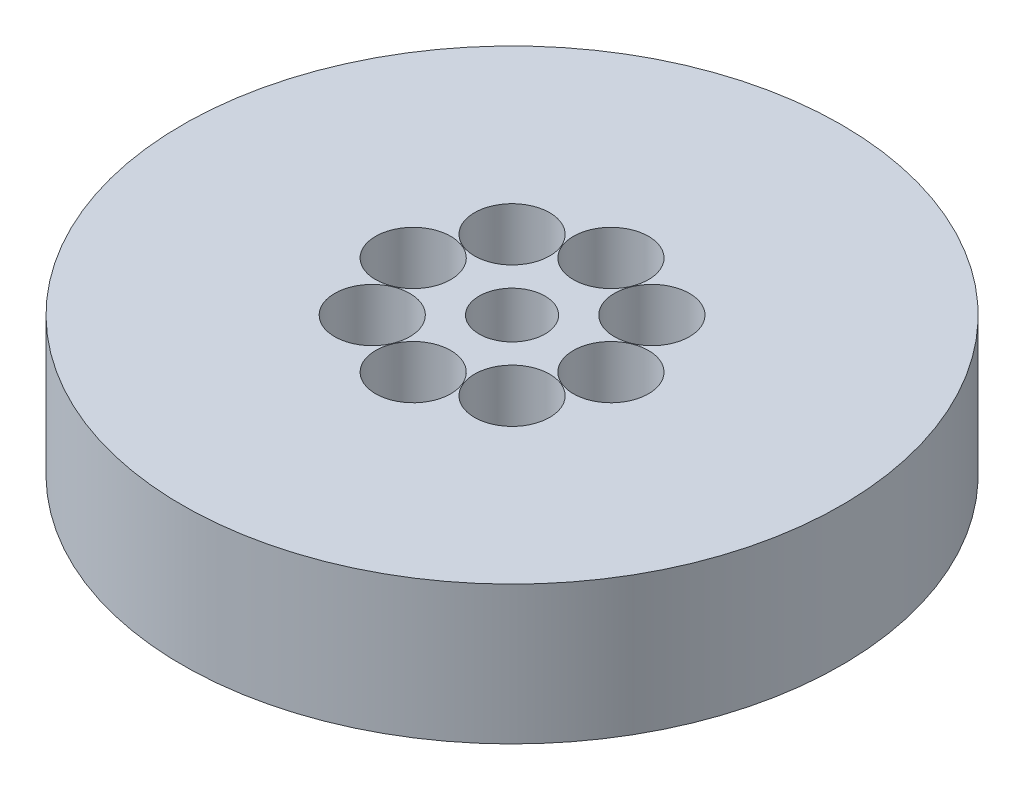
ISO-10303-21;
HEADER;
FILE_DESCRIPTION(('STEP AP214'),'2;1');
FILE_NAME('part.step','',(''),(''),'','','');
FILE_SCHEMA(('AUTOMOTIVE_DESIGN { 1 0 10303 214 1 1 1 1 }'));
ENDSEC;
DATA;
#1=APPLICATION_CONTEXT('core data for automotive mechanical design processes');
#2=APPLICATION_PROTOCOL_DEFINITION('international standard','automotive_design',2000,#1);
#3=PRODUCT_CONTEXT('',#1,'mechanical');
#4=PRODUCT('Part','Part','',(#3));
#5=PRODUCT_RELATED_PRODUCT_CATEGORY('part','',(#4));
#6=PRODUCT_DEFINITION_FORMATION('','',#4);
#7=PRODUCT_DEFINITION_CONTEXT('part definition',#1,'design');
#8=PRODUCT_DEFINITION('design','',#6,#7);
#9=PRODUCT_DEFINITION_SHAPE('','',#8);
#10=(LENGTH_UNIT() NAMED_UNIT(*) SI_UNIT(.MILLI.,.METRE.));
#11=(NAMED_UNIT(*) PLANE_ANGLE_UNIT() SI_UNIT($,.RADIAN.));
#12=(NAMED_UNIT(*) SI_UNIT($,.STERADIAN.) SOLID_ANGLE_UNIT());
#13=UNCERTAINTY_MEASURE_WITH_UNIT(LENGTH_MEASURE(1.E-05),#10,'distance_accuracy_value','');
#14=(GEOMETRIC_REPRESENTATION_CONTEXT(3) GLOBAL_UNCERTAINTY_ASSIGNED_CONTEXT((#13)) GLOBAL_UNIT_ASSIGNED_CONTEXT((#10,
#11,#12)) REPRESENTATION_CONTEXT('',''));
#15=CARTESIAN_POINT('',(0.,0.,0.));
#16=DIRECTION('',(0.,0.,1.));
#17=DIRECTION('',(1.,0.,0.));
#18=AXIS2_PLACEMENT_3D('',#15,#16,#17);
#19=CARTESIAN_POINT('',(0.,21.,0.));
#20=DIRECTION('',(0.,-1.,0.));
#21=DIRECTION('',(0.,0.,-1.));
#22=AXIS2_PLACEMENT_3D('',#19,#20,#21);
#23=CYLINDRICAL_SURFACE('',#22,50.);
#24=CARTESIAN_POINT('',(0.,21.,0.));
#25=DIRECTION('',(0.,1.,0.));
#26=DIRECTION('',(0.,0.,1.));
#27=AXIS2_PLACEMENT_3D('',#24,#25,#26);
#28=CIRCLE('',#27,50.);
#29=CARTESIAN_POINT('',(0.,21.,-50.));
#30=VERTEX_POINT('',#29);
#31=EDGE_CURVE('E10',#30,#30,#28,.T.);
#32=CARTESIAN_POINT('',(0.,0.,0.));
#33=DIRECTION('',(0.,1.,0.));
#34=DIRECTION('',(0.,0.,1.));
#35=AXIS2_PLACEMENT_3D('',#32,#33,#34);
#36=CIRCLE('',#35,50.);
#37=CARTESIAN_POINT('',(0.,0.,-50.));
#38=VERTEX_POINT('',#37);
#39=EDGE_CURVE('E37',#38,#38,#36,.T.);
#40=CARTESIAN_POINT('',(0.,21.,-50.));
#41=CARTESIAN_POINT('',(0.,20.78125,-50.));
#42=CARTESIAN_POINT('',(0.,20.5625,-50.));
#43=CARTESIAN_POINT('',(0.,20.125,-50.));
#44=CARTESIAN_POINT('',(0.,19.90625,-50.));
#45=CARTESIAN_POINT('',(0.,19.46875,-50.));
#46=CARTESIAN_POINT('',(0.,19.25,-50.));
#47=CARTESIAN_POINT('',(0.,18.8125,-50.));
#48=CARTESIAN_POINT('',(0.,18.59375,-50.));
#49=CARTESIAN_POINT('',(0.,18.15625,-50.));
#50=CARTESIAN_POINT('',(0.,17.9375,-50.));
#51=CARTESIAN_POINT('',(0.,17.5,-50.));
#52=CARTESIAN_POINT('',(0.,17.28125,-50.));
#53=CARTESIAN_POINT('',(0.,16.84375,-50.));
#54=CARTESIAN_POINT('',(0.,16.625,-50.));
#55=CARTESIAN_POINT('',(0.,16.1875,-50.));
#56=CARTESIAN_POINT('',(0.,15.96875,-50.));
#57=CARTESIAN_POINT('',(0.,15.53125,-50.));
#58=CARTESIAN_POINT('',(0.,15.3125,-50.));
#59=CARTESIAN_POINT('',(0.,14.875,-50.));
#60=CARTESIAN_POINT('',(0.,14.65625,-50.));
#61=CARTESIAN_POINT('',(0.,14.21875,-50.));
#62=CARTESIAN_POINT('',(0.,14.,-50.));
#63=CARTESIAN_POINT('',(0.,13.5625,-50.));
#64=CARTESIAN_POINT('',(0.,13.34375,-50.));
#65=CARTESIAN_POINT('',(0.,12.90625,-50.));
#66=CARTESIAN_POINT('',(0.,12.6875,-50.));
#67=CARTESIAN_POINT('',(0.,12.25,-50.));
#68=CARTESIAN_POINT('',(0.,12.03125,-50.));
#69=CARTESIAN_POINT('',(0.,11.59375,-50.));
#70=CARTESIAN_POINT('',(0.,11.375,-50.));
#71=CARTESIAN_POINT('',(0.,10.9375,-50.));
#72=CARTESIAN_POINT('',(0.,10.71875,-50.));
#73=CARTESIAN_POINT('',(0.,10.28125,-50.));
#74=CARTESIAN_POINT('',(0.,10.0625,-50.));
#75=CARTESIAN_POINT('',(0.,9.625,-50.));
#76=CARTESIAN_POINT('',(0.,9.40625,-50.));
#77=CARTESIAN_POINT('',(0.,8.96875,-50.));
#78=CARTESIAN_POINT('',(0.,8.75,-50.));
#79=CARTESIAN_POINT('',(0.,8.3125,-50.));
#80=CARTESIAN_POINT('',(0.,8.09375,-50.));
#81=CARTESIAN_POINT('',(0.,7.65625,-50.));
#82=CARTESIAN_POINT('',(0.,7.4375,-50.));
#83=CARTESIAN_POINT('',(0.,7.,-50.));
#84=CARTESIAN_POINT('',(0.,6.78125,-50.));
#85=CARTESIAN_POINT('',(0.,6.34375,-50.));
#86=CARTESIAN_POINT('',(0.,6.125,-50.));
#87=CARTESIAN_POINT('',(0.,5.6875,-50.));
#88=CARTESIAN_POINT('',(0.,5.46875,-50.));
#89=CARTESIAN_POINT('',(0.,5.03125,-50.));
#90=CARTESIAN_POINT('',(0.,4.8125,-50.));
#91=CARTESIAN_POINT('',(0.,4.375,-50.));
#92=CARTESIAN_POINT('',(0.,4.15625,-50.));
#93=CARTESIAN_POINT('',(0.,3.71875,-50.));
#94=CARTESIAN_POINT('',(0.,3.5,-50.));
#95=CARTESIAN_POINT('',(0.,3.0625,-50.));
#96=CARTESIAN_POINT('',(0.,2.84375,-50.));
#97=CARTESIAN_POINT('',(0.,2.40625,-50.));
#98=CARTESIAN_POINT('',(0.,2.1875,-50.));
#99=CARTESIAN_POINT('',(0.,1.75,-50.));
#100=CARTESIAN_POINT('',(0.,1.53125,-50.));
#101=CARTESIAN_POINT('',(0.,1.09375,-50.));
#102=CARTESIAN_POINT('',(0.,0.875000000000001,-50.));
#103=CARTESIAN_POINT('',(0.,0.4375,-50.));
#104=CARTESIAN_POINT('',(0.,0.21875,-50.));
#105=CARTESIAN_POINT('',(0.,0.,-50.));
#106=B_SPLINE_CURVE_WITH_KNOTS('',3,(#40,#41,#42,#43,#44,#45,#46,#47,#48,#49,#50,#51,#52,#53,
#54,#55,#56,#57,#58,#59,#60,#61,#62,#63,#64,#65,#66,#67,#68,#69,#70,#71,#72,#73,#74,#75,#76,#77,
#78,#79,#80,#81,#82,#83,#84,#85,#86,#87,#88,#89,#90,#91,#92,#93,#94,#95,#96,#97,#98,#99,#100,
#101,#102,#103,#104,#105),.UNSPECIFIED.,.F.,.F.,(4,2,2,2,2,2,2,2,2,2,2,2,2,2,2,2,2,2,2,2,2,2,2,
2,2,2,2,2,2,2,2,2,4),(0.,0.656249999999997,1.3125,1.96875,2.625,3.28125,3.9375,4.59375,5.25,
5.90625,6.5625,7.21875,7.875,8.53125,9.1875,9.84375,10.5,11.15625,11.8125,12.46875,13.125,
13.78125,14.4375,15.09375,15.75,16.40625,17.0625,17.71875,18.375,19.03125,19.6875,20.34375,21.),.UNSPECIFIED.);
#107=EDGE_CURVE('BSEAM40',#30,#38,#106,.T.);
#108=ORIENTED_EDGE('',*,*,#31,.F.);
#109=ORIENTED_EDGE('',*,*,#39,.T.);
#110=ORIENTED_EDGE('',*,*,#107,.T.);
#111=ORIENTED_EDGE('',*,*,#107,.F.);
#112=EDGE_LOOP('',(#108,#110,#109,#111));
#113=FACE_BOUND('',#112,.T.);
#114=ADVANCED_FACE('F40',(#113),#23,.T.);
#115=CARTESIAN_POINT('',(0.,21.,0.));
#116=DIRECTION('',(0.,1.,0.));
#117=DIRECTION('',(0.,0.,1.));
#118=AXIS2_PLACEMENT_3D('',#115,#116,#117);
#119=PLANE('',#118);
#120=CARTESIAN_POINT('',(14.9996395771217,21.,0.));
#121=DIRECTION('',(0.,1.,0.));
#122=DIRECTION('',(0.,0.,-1.));
#123=AXIS2_PLACEMENT_3D('',#120,#121,#122);
#124=CIRCLE('',#123,5.69945795650635);
#125=CARTESIAN_POINT('',(14.9996395771217,21.,-5.69945795650635));
#126=VERTEX_POINT('',#125);
#127=EDGE_CURVE('E78',#126,#126,#124,.T.);
#128=ORIENTED_EDGE('',*,*,#127,.F.);
#129=EDGE_LOOP('',(#128));
#130=FACE_BOUND('',#129,.T.);
#131=CARTESIAN_POINT('',(10.6063468603368,21.,-10.6063468603369));
#132=DIRECTION('',(0.,1.,0.));
#133=DIRECTION('',(-0.707106781186554,0.,-0.707106781186541));
#134=AXIS2_PLACEMENT_3D('',#131,#132,#133);
#135=CIRCLE('',#134,5.69945795650635);
#136=CARTESIAN_POINT('',(6.57622149020346,21.,-14.6364722304702));
#137=VERTEX_POINT('',#136);
#138=EDGE_CURVE('E84',#137,#137,#135,.T.);
#139=ORIENTED_EDGE('',*,*,#138,.F.);
#140=EDGE_LOOP('',(#139));
#141=FACE_BOUND('',#140,.T.);
#142=CARTESIAN_POINT('',(0.,21.,14.9996395771217));
#143=DIRECTION('',(0.,1.,0.));
#144=DIRECTION('',(1.,0.,0.));
#145=AXIS2_PLACEMENT_3D('',#142,#143,#144);
#146=CIRCLE('',#145,5.69945795650635);
#147=CARTESIAN_POINT('',(5.6994579565064,21.,14.9996395771216));
#148=VERTEX_POINT('',#147);
#149=EDGE_CURVE('E70',#148,#148,#146,.T.);
#150=ORIENTED_EDGE('',*,*,#149,.F.);
#151=EDGE_LOOP('',(#150));
#152=FACE_BOUND('',#151,.T.);
#153=CARTESIAN_POINT('',(10.6063468603369,21.,10.6063468603368));
#154=DIRECTION('',(0.,1.,0.));
#155=DIRECTION('',(0.707106781186544,0.,-0.707106781186551));
#156=AXIS2_PLACEMENT_3D('',#153,#154,#155);
#157=CIRCLE('',#156,5.69945795650635);
#158=CARTESIAN_POINT('',(14.6364722304701,21.,6.57622149020351));
#159=VERTEX_POINT('',#158);
#160=EDGE_CURVE('E71',#159,#159,#157,.T.);
#161=ORIENTED_EDGE('',*,*,#160,.F.);
#162=EDGE_LOOP('',(#161));
#163=FACE_BOUND('',#162,.T.);
#164=CARTESIAN_POINT('',(-10.606346860337,21.,-10.6063468603367));
#165=DIRECTION('',(0.,1.,0.));
#166=DIRECTION('',(-0.707106781186539,0.,0.707106781186556));
#167=AXIS2_PLACEMENT_3D('',#164,#165,#166);
#168=CIRCLE('',#167,5.69945795650635);
#169=CARTESIAN_POINT('',(-14.6364722304702,21.,-6.57622149020341));
#170=VERTEX_POINT('',#169);
#171=EDGE_CURVE('E100',#170,#170,#168,.T.);
#172=ORIENTED_EDGE('',*,*,#171,.F.);
#173=EDGE_LOOP('',(#172));
#174=FACE_BOUND('',#173,.T.);
#175=CARTESIAN_POINT('',(-1.5711288501868E-13,21.,-14.9996395771217));
#176=DIRECTION('',(0.,1.,0.));
#177=DIRECTION('',(-1.,0.,0.));
#178=AXIS2_PLACEMENT_3D('',#175,#176,#177);
#179=CIRCLE('',#178,5.69945795650635);
#180=CARTESIAN_POINT('',(-5.69945795650651,21.,-14.9996395771216));
#181=VERTEX_POINT('',#180);
#182=EDGE_CURVE('E93',#181,#181,#179,.T.);
#183=ORIENTED_EDGE('',*,*,#182,.F.);
#184=EDGE_LOOP('',(#183));
#185=FACE_BOUND('',#184,.T.);
#186=CARTESIAN_POINT('',(-10.6063468603368,21.,10.6063468603369));
#187=DIRECTION('',(0.,1.,0.));
#188=DIRECTION('',(0.707106781186549,0.,0.707106781186546));
#189=AXIS2_PLACEMENT_3D('',#186,#187,#188);
#190=CIRCLE('',#189,5.69945795650635);
#191=CARTESIAN_POINT('',(-6.57622149020356,21.,14.6364722304701));
#192=VERTEX_POINT('',#191);
#193=EDGE_CURVE('E61',#192,#192,#190,.T.);
#194=ORIENTED_EDGE('',*,*,#193,.F.);
#195=EDGE_LOOP('',(#194));
#196=FACE_BOUND('',#195,.T.);
#197=CARTESIAN_POINT('',(-14.9996395771217,21.,0.));
#198=DIRECTION('',(0.,1.,0.));
#199=DIRECTION('',(0.,0.,1.));
#200=AXIS2_PLACEMENT_3D('',#197,#198,#199);
#201=CIRCLE('',#200,5.69945795650635);
#202=CARTESIAN_POINT('',(-14.9996395771217,21.,5.69945795650635));
#203=VERTEX_POINT('',#202);
#204=EDGE_CURVE('E54',#203,#203,#201,.T.);
#205=ORIENTED_EDGE('',*,*,#204,.F.);
#206=EDGE_LOOP('',(#205));
#207=FACE_BOUND('',#206,.T.);
#208=CARTESIAN_POINT('',(0.,21.,0.));
#209=DIRECTION('',(0.,1.,0.));
#210=DIRECTION('',(0.,0.,1.));
#211=AXIS2_PLACEMENT_3D('',#208,#209,#210);
#212=CIRCLE('',#211,5.);
#213=CARTESIAN_POINT('',(0.,21.,-5.));
#214=VERTEX_POINT('',#213);
#215=EDGE_CURVE('E50',#214,#214,#212,.T.);
#216=ORIENTED_EDGE('',*,*,#215,.F.);
#217=EDGE_LOOP('',(#216));
#218=FACE_BOUND('',#217,.T.);
#219=ORIENTED_EDGE('',*,*,#31,.T.);
#220=EDGE_LOOP('',(#219));
#221=FACE_BOUND('',#220,.T.);
#222=ADVANCED_FACE('F115',(#130,#141,#152,#163,#174,#185,#196,#207,#218,#221),#119,.T.);
#223=CARTESIAN_POINT('',(0.,0.,0.));
#224=DIRECTION('',(0.,1.,0.));
#225=DIRECTION('',(0.,0.,1.));
#226=AXIS2_PLACEMENT_3D('',#223,#224,#225);
#227=PLANE('',#226);
#228=CARTESIAN_POINT('',(0.,0.,0.));
#229=DIRECTION('',(0.,1.,0.));
#230=DIRECTION('',(0.,0.,1.));
#231=AXIS2_PLACEMENT_3D('',#228,#229,#230);
#232=CIRCLE('',#231,5.);
#233=CARTESIAN_POINT('',(0.,0.,-5.));
#234=VERTEX_POINT('',#233);
#235=EDGE_CURVE('E47',#234,#234,#232,.T.);
#236=ORIENTED_EDGE('',*,*,#235,.T.);
#237=EDGE_LOOP('',(#236));
#238=FACE_BOUND('',#237,.T.);
#239=ORIENTED_EDGE('',*,*,#39,.F.);
#240=EDGE_LOOP('',(#239));
#241=FACE_BOUND('',#240,.T.);
#242=ADVANCED_FACE('F113',(#238,#241),#227,.F.);
#243=CARTESIAN_POINT('',(0.,21.,0.));
#244=DIRECTION('',(0.,-1.,0.));
#245=DIRECTION('',(0.,0.,-1.));
#246=AXIS2_PLACEMENT_3D('',#243,#244,#245);
#247=CYLINDRICAL_SURFACE('',#246,5.);
#248=CARTESIAN_POINT('',(0.,21.,-5.));
#249=CARTESIAN_POINT('',(0.,20.78125,-5.));
#250=CARTESIAN_POINT('',(0.,20.5625,-5.));
#251=CARTESIAN_POINT('',(0.,20.125,-5.));
#252=CARTESIAN_POINT('',(0.,19.90625,-5.));
#253=CARTESIAN_POINT('',(0.,19.46875,-5.));
#254=CARTESIAN_POINT('',(0.,19.25,-5.));
#255=CARTESIAN_POINT('',(0.,18.8125,-5.));
#256=CARTESIAN_POINT('',(0.,18.59375,-5.));
#257=CARTESIAN_POINT('',(0.,18.15625,-5.));
#258=CARTESIAN_POINT('',(0.,17.9375,-5.));
#259=CARTESIAN_POINT('',(0.,17.5,-5.));
#260=CARTESIAN_POINT('',(0.,17.28125,-5.));
#261=CARTESIAN_POINT('',(0.,16.84375,-5.));
#262=CARTESIAN_POINT('',(0.,16.625,-5.));
#263=CARTESIAN_POINT('',(0.,16.1875,-5.));
#264=CARTESIAN_POINT('',(0.,15.96875,-5.));
#265=CARTESIAN_POINT('',(0.,15.53125,-5.));
#266=CARTESIAN_POINT('',(0.,15.3125,-5.));
#267=CARTESIAN_POINT('',(0.,14.875,-5.));
#268=CARTESIAN_POINT('',(0.,14.65625,-5.));
#269=CARTESIAN_POINT('',(0.,14.21875,-5.));
#270=CARTESIAN_POINT('',(0.,14.,-5.));
#271=CARTESIAN_POINT('',(0.,13.5625,-5.));
#272=CARTESIAN_POINT('',(0.,13.34375,-5.));
#273=CARTESIAN_POINT('',(0.,12.90625,-5.));
#274=CARTESIAN_POINT('',(0.,12.6875,-5.));
#275=CARTESIAN_POINT('',(0.,12.25,-5.));
#276=CARTESIAN_POINT('',(0.,12.03125,-5.));
#277=CARTESIAN_POINT('',(0.,11.59375,-5.));
#278=CARTESIAN_POINT('',(0.,11.375,-5.));
#279=CARTESIAN_POINT('',(0.,10.9375,-5.));
#280=CARTESIAN_POINT('',(0.,10.71875,-5.));
#281=CARTESIAN_POINT('',(0.,10.28125,-5.));
#282=CARTESIAN_POINT('',(0.,10.0625,-5.));
#283=CARTESIAN_POINT('',(0.,9.625,-5.));
#284=CARTESIAN_POINT('',(0.,9.40625,-5.));
#285=CARTESIAN_POINT('',(0.,8.96875,-5.));
#286=CARTESIAN_POINT('',(0.,8.75,-5.));
#287=CARTESIAN_POINT('',(0.,8.3125,-5.));
#288=CARTESIAN_POINT('',(0.,8.09375,-5.));
#289=CARTESIAN_POINT('',(0.,7.65625,-5.));
#290=CARTESIAN_POINT('',(0.,7.4375,-5.));
#291=CARTESIAN_POINT('',(0.,7.,-5.));
#292=CARTESIAN_POINT('',(0.,6.78125,-5.));
#293=CARTESIAN_POINT('',(0.,6.34375,-5.));
#294=CARTESIAN_POINT('',(0.,6.125,-5.));
#295=CARTESIAN_POINT('',(0.,5.6875,-5.));
#296=CARTESIAN_POINT('',(0.,5.46875,-5.));
#297=CARTESIAN_POINT('',(0.,5.03125,-5.));
#298=CARTESIAN_POINT('',(0.,4.8125,-5.));
#299=CARTESIAN_POINT('',(0.,4.375,-5.));
#300=CARTESIAN_POINT('',(0.,4.15625,-5.));
#301=CARTESIAN_POINT('',(0.,3.71875,-5.));
#302=CARTESIAN_POINT('',(0.,3.5,-5.));
#303=CARTESIAN_POINT('',(0.,3.0625,-5.));
#304=CARTESIAN_POINT('',(0.,2.84375,-5.));
#305=CARTESIAN_POINT('',(0.,2.40625,-5.));
#306=CARTESIAN_POINT('',(0.,2.1875,-5.));
#307=CARTESIAN_POINT('',(0.,1.75,-5.));
#308=CARTESIAN_POINT('',(0.,1.53125,-5.));
#309=CARTESIAN_POINT('',(0.,1.09375,-5.));
#310=CARTESIAN_POINT('',(0.,0.875000000000001,-5.));
#311=CARTESIAN_POINT('',(0.,0.4375,-5.));
#312=CARTESIAN_POINT('',(0.,0.21875,-5.));
#313=CARTESIAN_POINT('',(0.,0.,-5.));
#314=B_SPLINE_CURVE_WITH_KNOTS('',3,(#248,#249,#250,#251,#252,#253,#254,#255,#256,#257,#258,
#259,#260,#261,#262,#263,#264,#265,#266,#267,#268,#269,#270,#271,#272,#273,#274,#275,#276,#277,
#278,#279,#280,#281,#282,#283,#284,#285,#286,#287,#288,#289,#290,#291,#292,#293,#294,#295,#296,
#297,#298,#299,#300,#301,#302,#303,#304,#305,#306,#307,#308,#309,#310,#311,#312,#313),
.UNSPECIFIED.,.F.,.F.,(4,2,2,2,2,2,2,2,2,2,2,2,2,2,2,2,2,2,2,2,2,2,2,2,2,2,2,2,2,2,2,2,4),(0.,
0.656250000000001,1.3125,1.96875,2.625,3.28125,3.9375,4.59375,5.25,5.90625,6.5625,7.21875,7.875,
8.53125,9.1875,9.84375,10.5,11.15625,11.8125,12.46875,13.125,13.78125,14.4375,15.09375,15.75,
16.40625,17.0625,17.71875,18.375,19.03125,19.6875,20.34375,21.),.UNSPECIFIED.);
#315=EDGE_CURVE('BSEAM127',#214,#234,#314,.T.);
#316=ORIENTED_EDGE('',*,*,#215,.T.);
#317=ORIENTED_EDGE('',*,*,#235,.F.);
#318=ORIENTED_EDGE('',*,*,#315,.T.);
#319=ORIENTED_EDGE('',*,*,#315,.F.);
#320=EDGE_LOOP('',(#316,#318,#317,#319));
#321=FACE_BOUND('',#320,.T.);
#322=ADVANCED_FACE('F127',(#321),#247,.F.);
#323=CARTESIAN_POINT('',(-14.9996395771217,0.473449359081543,0.));
#324=DIRECTION('',(0.,1.,0.));
#325=DIRECTION('',(0.,0.,1.));
#326=AXIS2_PLACEMENT_3D('',#323,#324,#325);
#327=CYLINDRICAL_SURFACE('',#326,5.69945795650635);
#328=CARTESIAN_POINT('',(-14.9996395771217,0.473449359081543,0.));
#329=DIRECTION('',(0.,1.,0.));
#330=DIRECTION('',(0.,0.,1.));
#331=AXIS2_PLACEMENT_3D('',#328,#329,#330);
#332=CIRCLE('',#331,5.69945795650635);
#333=CARTESIAN_POINT('',(-14.9996395771217,0.473449359081543,5.69945795650635));
#334=VERTEX_POINT('',#333);
#335=EDGE_CURVE('E55',#334,#334,#332,.T.);
#336=ORIENTED_EDGE('',*,*,#335,.F.);
#337=EDGE_LOOP('',(#336));
#338=FACE_BOUND('',#337,.T.);
#339=ORIENTED_EDGE('',*,*,#204,.T.);
#340=EDGE_LOOP('',(#339));
#341=FACE_BOUND('',#340,.T.);
#342=ADVANCED_FACE('F129',(#338,#341),#327,.F.);
#343=CARTESIAN_POINT('',(-14.9996395771217,0.473449359081543,0.));
#344=DIRECTION('',(0.,1.,0.));
#345=DIRECTION('',(0.,0.,1.));
#346=AXIS2_PLACEMENT_3D('',#343,#344,#345);
#347=PLANE('',#346);
#348=ORIENTED_EDGE('',*,*,#335,.T.);
#349=EDGE_LOOP('',(#348));
#350=FACE_BOUND('',#349,.T.);
#351=ADVANCED_FACE('F157',(#350),#347,.T.);
#352=CARTESIAN_POINT('',(-10.6063468603368,0.473449359081543,10.6063468603369));
#353=DIRECTION('',(0.,1.,0.));
#354=DIRECTION('',(0.,0.,1.));
#355=AXIS2_PLACEMENT_3D('',#352,#353,#354);
#356=CYLINDRICAL_SURFACE('',#355,5.69945795650635);
#357=CARTESIAN_POINT('',(-10.6063468603368,0.473449359081543,10.6063468603369));
#358=DIRECTION('',(0.,1.,0.));
#359=DIRECTION('',(0.707106781186549,0.,0.707106781186546));
#360=AXIS2_PLACEMENT_3D('',#357,#358,#359);
#361=CIRCLE('',#360,5.69945795650635);
#362=CARTESIAN_POINT('',(-6.57622149020356,0.473449359081543,14.6364722304701));
#363=VERTEX_POINT('',#362);
#364=EDGE_CURVE('E59',#363,#363,#361,.T.);
#365=ORIENTED_EDGE('',*,*,#364,.F.);
#366=EDGE_LOOP('',(#365));
#367=FACE_BOUND('',#366,.T.);
#368=ORIENTED_EDGE('',*,*,#193,.T.);
#369=EDGE_LOOP('',(#368));
#370=FACE_BOUND('',#369,.T.);
#371=ADVANCED_FACE('F170',(#367,#370),#356,.F.);
#372=CARTESIAN_POINT('',(-10.6063468603368,0.473449359081543,10.6063468603369));
#373=DIRECTION('',(0.,1.,0.));
#374=DIRECTION('',(0.707106781186549,0.,0.707106781186546));
#375=AXIS2_PLACEMENT_3D('',#372,#373,#374);
#376=PLANE('',#375);
#377=ORIENTED_EDGE('',*,*,#364,.T.);
#378=EDGE_LOOP('',(#377));
#379=FACE_BOUND('',#378,.T.);
#380=ADVANCED_FACE('F182',(#379),#376,.T.);
#381=CARTESIAN_POINT('',(-1.5711288501868E-13,0.473449359081543,-14.9996395771217));
#382=DIRECTION('',(0.,1.,0.));
#383=DIRECTION('',(0.,0.,1.));
#384=AXIS2_PLACEMENT_3D('',#381,#382,#383);
#385=CYLINDRICAL_SURFACE('',#384,5.69945795650635);
#386=CARTESIAN_POINT('',(-1.5711288501868E-13,0.473449359081543,-14.9996395771217));
#387=DIRECTION('',(0.,1.,0.));
#388=DIRECTION('',(-1.,0.,0.));
#389=AXIS2_PLACEMENT_3D('',#386,#387,#388);
#390=CIRCLE('',#389,5.69945795650635);
#391=CARTESIAN_POINT('',(-5.69945795650651,0.473449359081543,-14.9996395771216));
#392=VERTEX_POINT('',#391);
#393=EDGE_CURVE('E86',#392,#392,#390,.T.);
#394=ORIENTED_EDGE('',*,*,#393,.F.);
#395=EDGE_LOOP('',(#394));
#396=FACE_BOUND('',#395,.T.);
#397=ORIENTED_EDGE('',*,*,#182,.T.);
#398=EDGE_LOOP('',(#397));
#399=FACE_BOUND('',#398,.T.);
#400=ADVANCED_FACE('F189',(#396,#399),#385,.F.);
#401=CARTESIAN_POINT('',(-1.5711288501868E-13,0.473449359081543,-14.9996395771217));
#402=DIRECTION('',(0.,1.,0.));
#403=DIRECTION('',(-1.,0.,0.));
#404=AXIS2_PLACEMENT_3D('',#401,#402,#403);
#405=PLANE('',#404);
#406=ORIENTED_EDGE('',*,*,#393,.T.);
#407=EDGE_LOOP('',(#406));
#408=FACE_BOUND('',#407,.T.);
#409=ADVANCED_FACE('F107',(#408),#405,.T.);
#410=CARTESIAN_POINT('',(-10.606346860337,0.473449359081543,-10.6063468603367));
#411=DIRECTION('',(0.,1.,0.));
#412=DIRECTION('',(0.,0.,1.));
#413=AXIS2_PLACEMENT_3D('',#410,#411,#412);
#414=CYLINDRICAL_SURFACE('',#413,5.69945795650635);
#415=CARTESIAN_POINT('',(-10.606346860337,0.473449359081543,-10.6063468603367));
#416=DIRECTION('',(0.,1.,0.));
#417=DIRECTION('',(-0.707106781186539,0.,0.707106781186556));
#418=AXIS2_PLACEMENT_3D('',#415,#416,#417);
#419=CIRCLE('',#418,5.69945795650635);
#420=CARTESIAN_POINT('',(-14.6364722304702,0.473449359081543,-6.57622149020341));
#421=VERTEX_POINT('',#420);
#422=EDGE_CURVE('E94',#421,#421,#419,.T.);
#423=ORIENTED_EDGE('',*,*,#422,.F.);
#424=EDGE_LOOP('',(#423));
#425=FACE_BOUND('',#424,.T.);
#426=ORIENTED_EDGE('',*,*,#171,.T.);
#427=EDGE_LOOP('',(#426));
#428=FACE_BOUND('',#427,.T.);
#429=ADVANCED_FACE('F104',(#425,#428),#414,.F.);
#430=CARTESIAN_POINT('',(-10.606346860337,0.473449359081543,-10.6063468603367));
#431=DIRECTION('',(0.,1.,0.));
#432=DIRECTION('',(-0.707106781186539,0.,0.707106781186556));
#433=AXIS2_PLACEMENT_3D('',#430,#431,#432);
#434=PLANE('',#433);
#435=ORIENTED_EDGE('',*,*,#422,.T.);
#436=EDGE_LOOP('',(#435));
#437=FACE_BOUND('',#436,.T.);
#438=ADVANCED_FACE('F103',(#437),#434,.T.);
#439=CARTESIAN_POINT('',(10.6063468603369,0.473449359081543,10.6063468603368));
#440=DIRECTION('',(0.,1.,0.));
#441=DIRECTION('',(0.,0.,1.));
#442=AXIS2_PLACEMENT_3D('',#439,#440,#441);
#443=CYLINDRICAL_SURFACE('',#442,5.69945795650635);
#444=CARTESIAN_POINT('',(10.6063468603369,0.473449359081543,10.6063468603368));
#445=DIRECTION('',(0.,1.,0.));
#446=DIRECTION('',(0.707106781186544,0.,-0.707106781186551));
#447=AXIS2_PLACEMENT_3D('',#444,#445,#446);
#448=CIRCLE('',#447,5.69945795650635);
#449=CARTESIAN_POINT('',(14.6364722304701,0.473449359081543,6.57622149020351));
#450=VERTEX_POINT('',#449);
#451=EDGE_CURVE('E69',#450,#450,#448,.T.);
#452=ORIENTED_EDGE('',*,*,#451,.F.);
#453=EDGE_LOOP('',(#452));
#454=FACE_BOUND('',#453,.T.);
#455=ORIENTED_EDGE('',*,*,#160,.T.);
#456=EDGE_LOOP('',(#455));
#457=FACE_BOUND('',#456,.T.);
#458=ADVANCED_FACE('F219',(#454,#457),#443,.F.);
#459=CARTESIAN_POINT('',(10.6063468603369,0.473449359081543,10.6063468603368));
#460=DIRECTION('',(0.,1.,0.));
#461=DIRECTION('',(0.707106781186544,0.,-0.707106781186551));
#462=AXIS2_PLACEMENT_3D('',#459,#460,#461);
#463=PLANE('',#462);
#464=ORIENTED_EDGE('',*,*,#451,.T.);
#465=EDGE_LOOP('',(#464));
#466=FACE_BOUND('',#465,.T.);
#467=ADVANCED_FACE('F227',(#466),#463,.T.);
#468=CARTESIAN_POINT('',(0.,0.473449359081543,14.9996395771217));
#469=DIRECTION('',(0.,1.,0.));
#470=DIRECTION('',(0.,0.,1.));
#471=AXIS2_PLACEMENT_3D('',#468,#469,#470);
#472=CYLINDRICAL_SURFACE('',#471,5.69945795650635);
#473=CARTESIAN_POINT('',(0.,0.473449359081543,14.9996395771217));
#474=DIRECTION('',(0.,1.,0.));
#475=DIRECTION('',(1.,0.,0.));
#476=AXIS2_PLACEMENT_3D('',#473,#474,#475);
#477=CIRCLE('',#476,5.69945795650635);
#478=CARTESIAN_POINT('',(5.6994579565064,0.473449359081543,14.9996395771216));
#479=VERTEX_POINT('',#478);
#480=EDGE_CURVE('E63',#479,#479,#477,.T.);
#481=ORIENTED_EDGE('',*,*,#480,.F.);
#482=EDGE_LOOP('',(#481));
#483=FACE_BOUND('',#482,.T.);
#484=ORIENTED_EDGE('',*,*,#149,.T.);
#485=EDGE_LOOP('',(#484));
#486=FACE_BOUND('',#485,.T.);
#487=ADVANCED_FACE('F240',(#483,#486),#472,.F.);
#488=CARTESIAN_POINT('',(0.,0.473449359081543,14.9996395771217));
#489=DIRECTION('',(0.,1.,0.));
#490=DIRECTION('',(1.,0.,0.));
#491=AXIS2_PLACEMENT_3D('',#488,#489,#490);
#492=PLANE('',#491);
#493=ORIENTED_EDGE('',*,*,#480,.T.);
#494=EDGE_LOOP('',(#493));
#495=FACE_BOUND('',#494,.T.);
#496=ADVANCED_FACE('F246',(#495),#492,.T.);
#497=CARTESIAN_POINT('',(10.6063468603368,0.473449359081543,-10.6063468603369));
#498=DIRECTION('',(0.,1.,0.));
#499=DIRECTION('',(0.,0.,1.));
#500=AXIS2_PLACEMENT_3D('',#497,#498,#499);
#501=CYLINDRICAL_SURFACE('',#500,5.69945795650635);
#502=CARTESIAN_POINT('',(10.6063468603368,0.473449359081543,-10.6063468603369));
#503=DIRECTION('',(0.,1.,0.));
#504=DIRECTION('',(-0.707106781186554,0.,-0.707106781186541));
#505=AXIS2_PLACEMENT_3D('',#502,#503,#504);
#506=CIRCLE('',#505,5.69945795650635);
#507=CARTESIAN_POINT('',(6.57622149020346,0.473449359081543,-14.6364722304702));
#508=VERTEX_POINT('',#507);
#509=EDGE_CURVE('E85',#508,#508,#506,.T.);
#510=ORIENTED_EDGE('',*,*,#509,.F.);
#511=EDGE_LOOP('',(#510));
#512=FACE_BOUND('',#511,.T.);
#513=ORIENTED_EDGE('',*,*,#138,.T.);
#514=EDGE_LOOP('',(#513));
#515=FACE_BOUND('',#514,.T.);
#516=ADVANCED_FACE('F254',(#512,#515),#501,.F.);
#517=CARTESIAN_POINT('',(10.6063468603368,0.473449359081543,-10.6063468603369));
#518=DIRECTION('',(0.,1.,0.));
#519=DIRECTION('',(-0.707106781186554,0.,-0.707106781186541));
#520=AXIS2_PLACEMENT_3D('',#517,#518,#519);
#521=PLANE('',#520);
#522=ORIENTED_EDGE('',*,*,#509,.T.);
#523=EDGE_LOOP('',(#522));
#524=FACE_BOUND('',#523,.T.);
#525=ADVANCED_FACE('F262',(#524),#521,.T.);
#526=CARTESIAN_POINT('',(14.9996395771217,0.473449359081543,0.));
#527=DIRECTION('',(0.,1.,0.));
#528=DIRECTION('',(0.,0.,1.));
#529=AXIS2_PLACEMENT_3D('',#526,#527,#528);
#530=CYLINDRICAL_SURFACE('',#529,5.69945795650635);
#531=CARTESIAN_POINT('',(14.9996395771217,0.473449359081543,0.));
#532=DIRECTION('',(0.,1.,0.));
#533=DIRECTION('',(0.,0.,-1.));
#534=AXIS2_PLACEMENT_3D('',#531,#532,#533);
#535=CIRCLE('',#534,5.69945795650635);
#536=CARTESIAN_POINT('',(14.9996395771217,0.473449359081543,-5.69945795650635));
#537=VERTEX_POINT('',#536);
#538=EDGE_CURVE('E76',#537,#537,#535,.T.);
#539=ORIENTED_EDGE('',*,*,#538,.F.);
#540=EDGE_LOOP('',(#539));
#541=FACE_BOUND('',#540,.T.);
#542=ORIENTED_EDGE('',*,*,#127,.T.);
#543=EDGE_LOOP('',(#542));
#544=FACE_BOUND('',#543,.T.);
#545=ADVANCED_FACE('F272',(#541,#544),#530,.F.);
#546=CARTESIAN_POINT('',(14.9996395771217,0.473449359081543,0.));
#547=DIRECTION('',(0.,1.,0.));
#548=DIRECTION('',(0.,0.,-1.));
#549=AXIS2_PLACEMENT_3D('',#546,#547,#548);
#550=PLANE('',#549);
#551=ORIENTED_EDGE('',*,*,#538,.T.);
#552=EDGE_LOOP('',(#551));
#553=FACE_BOUND('',#552,.T.);
#554=ADVANCED_FACE('F285',(#553),#550,.T.);
#555=CLOSED_SHELL('',(#114,#222,#242,#322,#342,#351,#371,#380,#400,#409,#429,#438,#458,#467,
#487,#496,#516,#525,#545,#554));
#556=MANIFOLD_SOLID_BREP('B2',#555);
#557=ADVANCED_BREP_SHAPE_REPRESENTATION('',(#18,#556),#14);
#558=SHAPE_DEFINITION_REPRESENTATION(#9,#557);
ENDSEC;
END-ISO-10303-21;
